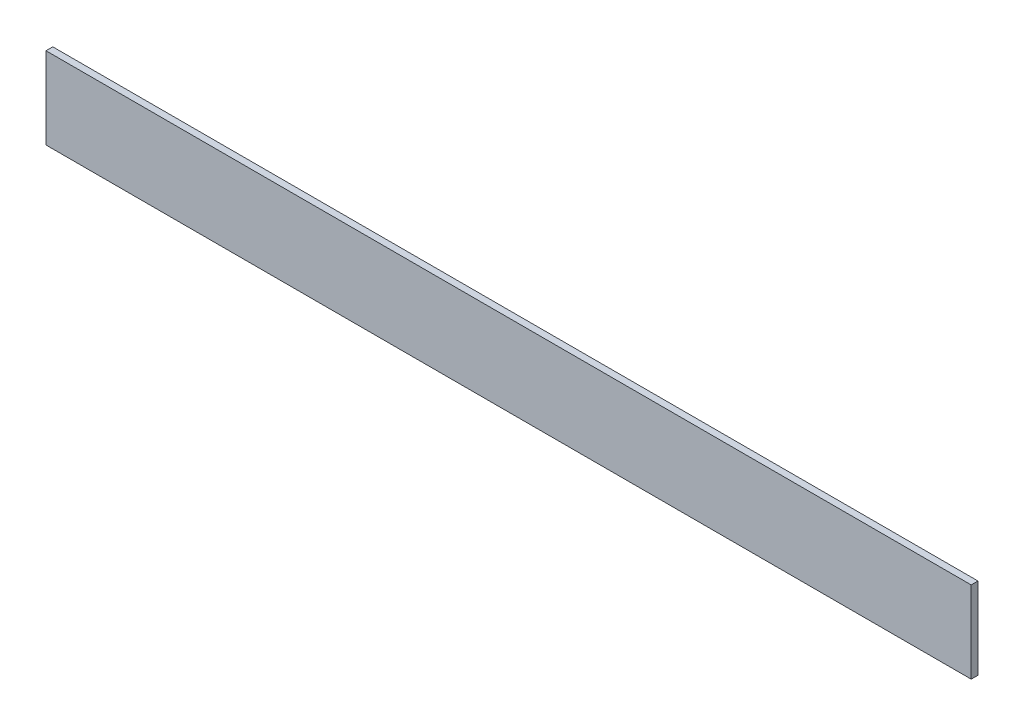
ISO-10303-21;
HEADER;
FILE_DESCRIPTION(('STEP AP214'),'2;1');
FILE_NAME('part.step','',(''),(''),'','','');
FILE_SCHEMA(('AUTOMOTIVE_DESIGN { 1 0 10303 214 1 1 1 1 }'));
ENDSEC;
DATA;
#1=APPLICATION_CONTEXT('core data for automotive mechanical design processes');
#2=APPLICATION_PROTOCOL_DEFINITION('international standard','automotive_design',2000,#1);
#3=PRODUCT_CONTEXT('',#1,'mechanical');
#4=PRODUCT('Part','Part','',(#3));
#5=PRODUCT_RELATED_PRODUCT_CATEGORY('part','',(#4));
#6=PRODUCT_DEFINITION_FORMATION('','',#4);
#7=PRODUCT_DEFINITION_CONTEXT('part definition',#1,'design');
#8=PRODUCT_DEFINITION('design','',#6,#7);
#9=PRODUCT_DEFINITION_SHAPE('','',#8);
#10=(LENGTH_UNIT() NAMED_UNIT(*) SI_UNIT(.MILLI.,.METRE.));
#11=(NAMED_UNIT(*) PLANE_ANGLE_UNIT() SI_UNIT($,.RADIAN.));
#12=(NAMED_UNIT(*) SI_UNIT($,.STERADIAN.) SOLID_ANGLE_UNIT());
#13=UNCERTAINTY_MEASURE_WITH_UNIT(LENGTH_MEASURE(1.E-05),#10,'distance_accuracy_value','');
#14=(GEOMETRIC_REPRESENTATION_CONTEXT(3) GLOBAL_UNCERTAINTY_ASSIGNED_CONTEXT((#13)) GLOBAL_UNIT_ASSIGNED_CONTEXT((#10,
#11,#12)) REPRESENTATION_CONTEXT('',''));
#15=CARTESIAN_POINT('',(0.,0.,0.));
#16=DIRECTION('',(0.,0.,1.));
#17=DIRECTION('',(1.,0.,0.));
#18=AXIS2_PLACEMENT_3D('',#15,#16,#17);
#19=CARTESIAN_POINT('',(863.6,-38.1,-3.175));
#20=DIRECTION('',(0.,0.,1.));
#21=DIRECTION('',(1.,0.,0.));
#22=AXIS2_PLACEMENT_3D('',#19,#20,#21);
#23=PLANE('',#22);
#24=DIRECTION('',(0.,1.,0.));
#25=VECTOR('',#24,1.);
#26=CARTESIAN_POINT('',(0.,-38.1,-3.175));
#27=LINE('',#26,#25);
#28=CARTESIAN_POINT('',(0.,-38.1,-3.175));
#29=VERTEX_POINT('',#28);
#30=CARTESIAN_POINT('',(0.,38.1,-3.175));
#31=VERTEX_POINT('',#30);
#32=EDGE_CURVE('E98',#29,#31,#27,.T.);
#33=ORIENTED_EDGE('',*,*,#32,.T.);
#34=DIRECTION('',(-1.,0.,0.));
#35=VECTOR('',#34,1.);
#36=CARTESIAN_POINT('',(863.6,38.1,-3.175));
#37=LINE('',#36,#35);
#38=CARTESIAN_POINT('',(863.6,38.1,-3.175));
#39=VERTEX_POINT('',#38);
#40=EDGE_CURVE('E11',#39,#31,#37,.T.);
#41=ORIENTED_EDGE('',*,*,#40,.F.);
#42=DIRECTION('',(0.,1.,0.));
#43=VECTOR('',#42,1.);
#44=CARTESIAN_POINT('',(863.6,-38.1,-3.175));
#45=LINE('',#44,#43);
#46=CARTESIAN_POINT('',(863.6,-38.1,-3.175));
#47=VERTEX_POINT('',#46);
#48=EDGE_CURVE('E86',#47,#39,#45,.T.);
#49=ORIENTED_EDGE('',*,*,#48,.F.);
#50=DIRECTION('',(-1.,0.,0.));
#51=VECTOR('',#50,1.);
#52=CARTESIAN_POINT('',(863.6,-38.1,-3.175));
#53=LINE('',#52,#51);
#54=EDGE_CURVE('E94',#47,#29,#53,.T.);
#55=ORIENTED_EDGE('',*,*,#54,.T.);
#56=EDGE_LOOP('',(#33,#41,#49,#55));
#57=FACE_BOUND('',#56,.T.);
#58=ADVANCED_FACE('F35',(#57),#23,.F.);
#59=CARTESIAN_POINT('',(863.6,38.1,3.175));
#60=DIRECTION('',(0.,-1.,0.));
#61=DIRECTION('',(0.,0.,-1.));
#62=AXIS2_PLACEMENT_3D('',#59,#60,#61);
#63=PLANE('',#62);
#64=DIRECTION('',(0.,0.,1.));
#65=VECTOR('',#64,1.);
#66=CARTESIAN_POINT('',(0.,38.1,3.175));
#67=LINE('',#66,#65);
#68=CARTESIAN_POINT('',(0.,38.1,3.175));
#69=VERTEX_POINT('',#68);
#70=EDGE_CURVE('E90',#31,#69,#67,.T.);
#71=ORIENTED_EDGE('',*,*,#70,.T.);
#72=DIRECTION('',(-1.,0.,0.));
#73=VECTOR('',#72,1.);
#74=CARTESIAN_POINT('',(863.6,38.1,3.175));
#75=LINE('',#74,#73);
#76=CARTESIAN_POINT('',(863.6,38.1,3.175));
#77=VERTEX_POINT('',#76);
#78=EDGE_CURVE('E43',#77,#69,#75,.T.);
#79=ORIENTED_EDGE('',*,*,#78,.F.);
#80=DIRECTION('',(0.,0.,1.));
#81=VECTOR('',#80,1.);
#82=CARTESIAN_POINT('',(863.6,38.1,3.175));
#83=LINE('',#82,#81);
#84=EDGE_CURVE('E81',#39,#77,#83,.T.);
#85=ORIENTED_EDGE('',*,*,#84,.F.);
#86=ORIENTED_EDGE('',*,*,#40,.T.);
#87=EDGE_LOOP('',(#71,#79,#85,#86));
#88=FACE_BOUND('',#87,.T.);
#89=ADVANCED_FACE('F89',(#88),#63,.F.);
#90=CARTESIAN_POINT('',(863.6,-38.1,3.175));
#91=DIRECTION('',(0.,0.,-1.));
#92=DIRECTION('',(-1.,0.,0.));
#93=AXIS2_PLACEMENT_3D('',#90,#91,#92);
#94=PLANE('',#93);
#95=DIRECTION('',(0.,-1.,0.));
#96=VECTOR('',#95,1.);
#97=CARTESIAN_POINT('',(0.,-38.1,3.175));
#98=LINE('',#97,#96);
#99=CARTESIAN_POINT('',(0.,-38.1,3.175));
#100=VERTEX_POINT('',#99);
#101=EDGE_CURVE('E68',#69,#100,#98,.T.);
#102=ORIENTED_EDGE('',*,*,#101,.T.);
#103=DIRECTION('',(-1.,0.,0.));
#104=VECTOR('',#103,1.);
#105=CARTESIAN_POINT('',(863.6,-38.1,3.175));
#106=LINE('',#105,#104);
#107=CARTESIAN_POINT('',(863.6,-38.1,3.175));
#108=VERTEX_POINT('',#107);
#109=EDGE_CURVE('E91',#108,#100,#106,.T.);
#110=ORIENTED_EDGE('',*,*,#109,.F.);
#111=DIRECTION('',(0.,-1.,0.));
#112=VECTOR('',#111,1.);
#113=CARTESIAN_POINT('',(863.6,-38.1,3.175));
#114=LINE('',#113,#112);
#115=EDGE_CURVE('E84',#77,#108,#114,.T.);
#116=ORIENTED_EDGE('',*,*,#115,.F.);
#117=ORIENTED_EDGE('',*,*,#78,.T.);
#118=EDGE_LOOP('',(#102,#110,#116,#117));
#119=FACE_BOUND('',#118,.T.);
#120=ADVANCED_FACE('F92',(#119),#94,.F.);
#121=CARTESIAN_POINT('',(863.6,-38.1,3.175));
#122=DIRECTION('',(0.,1.,0.));
#123=DIRECTION('',(0.,0.,1.));
#124=AXIS2_PLACEMENT_3D('',#121,#122,#123);
#125=PLANE('',#124);
#126=DIRECTION('',(0.,0.,-1.));
#127=VECTOR('',#126,1.);
#128=CARTESIAN_POINT('',(0.,-38.1,3.175));
#129=LINE('',#128,#127);
#130=EDGE_CURVE('E74',#100,#29,#129,.T.);
#131=ORIENTED_EDGE('',*,*,#130,.T.);
#132=ORIENTED_EDGE('',*,*,#54,.F.);
#133=DIRECTION('',(0.,0.,-1.));
#134=VECTOR('',#133,1.);
#135=CARTESIAN_POINT('',(863.6,-38.1,3.175));
#136=LINE('',#135,#134);
#137=EDGE_CURVE('E51',#108,#47,#136,.T.);
#138=ORIENTED_EDGE('',*,*,#137,.F.);
#139=ORIENTED_EDGE('',*,*,#109,.T.);
#140=EDGE_LOOP('',(#131,#132,#138,#139));
#141=FACE_BOUND('',#140,.T.);
#142=ADVANCED_FACE('F105',(#141),#125,.F.);
#143=CARTESIAN_POINT('',(863.6,0.,0.));
#144=DIRECTION('',(-1.,0.,0.));
#145=DIRECTION('',(0.,0.,1.));
#146=AXIS2_PLACEMENT_3D('',#143,#144,#145);
#147=PLANE('',#146);
#148=ORIENTED_EDGE('',*,*,#48,.T.);
#149=ORIENTED_EDGE('',*,*,#84,.T.);
#150=ORIENTED_EDGE('',*,*,#115,.T.);
#151=ORIENTED_EDGE('',*,*,#137,.T.);
#152=EDGE_LOOP('',(#148,#149,#150,#151));
#153=FACE_BOUND('',#152,.T.);
#154=ADVANCED_FACE('F82',(#153),#147,.F.);
#155=CARTESIAN_POINT('',(0.,0.,0.));
#156=DIRECTION('',(-1.,0.,0.));
#157=DIRECTION('',(0.,0.,1.));
#158=AXIS2_PLACEMENT_3D('',#155,#156,#157);
#159=PLANE('',#158);
#160=ORIENTED_EDGE('',*,*,#32,.F.);
#161=ORIENTED_EDGE('',*,*,#130,.F.);
#162=ORIENTED_EDGE('',*,*,#101,.F.);
#163=ORIENTED_EDGE('',*,*,#70,.F.);
#164=EDGE_LOOP('',(#160,#161,#162,#163));
#165=FACE_BOUND('',#164,.T.);
#166=ADVANCED_FACE('F108',(#165),#159,.T.);
#167=CLOSED_SHELL('',(#58,#89,#120,#142,#154,#166));
#168=MANIFOLD_SOLID_BREP('B2',#167);
#169=ADVANCED_BREP_SHAPE_REPRESENTATION('',(#18,#168),#14);
#170=SHAPE_DEFINITION_REPRESENTATION(#9,#169);
ENDSEC;
END-ISO-10303-21;
